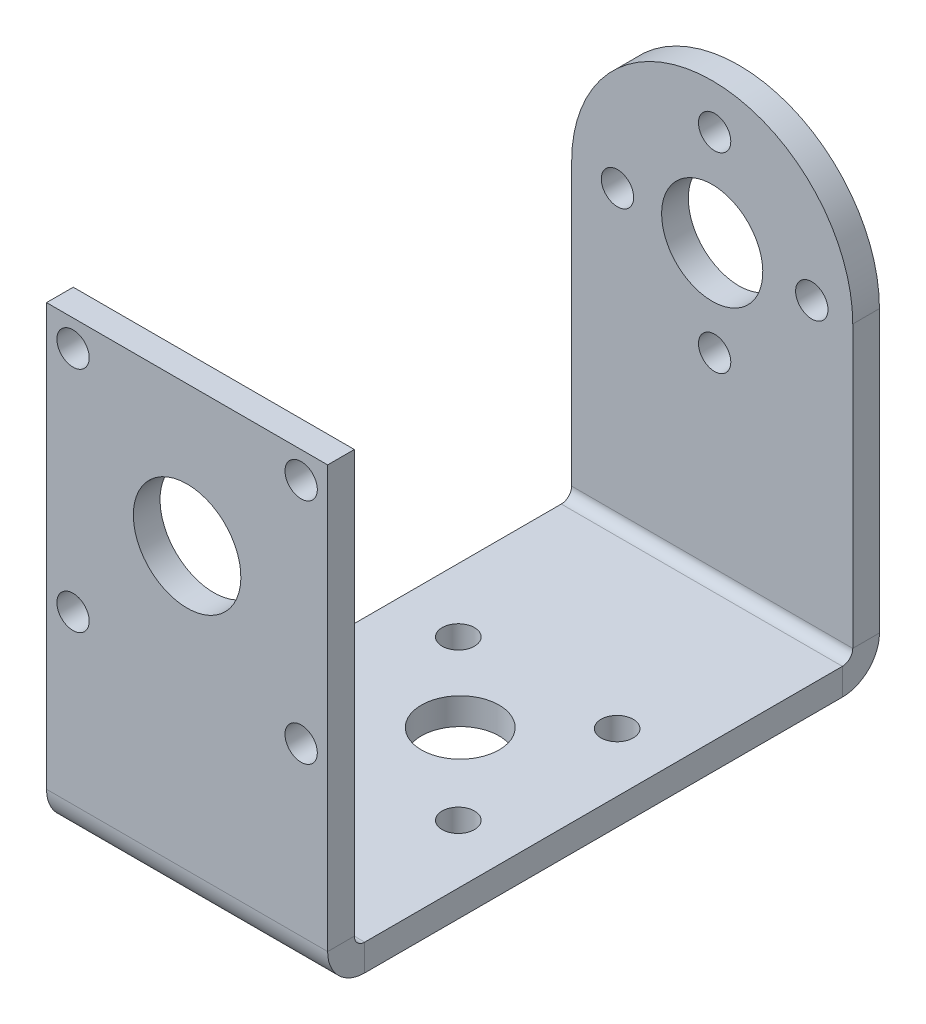
ISO-10303-21;
HEADER;
FILE_DESCRIPTION(('STEP AP214'),'2;1');
FILE_NAME('part.step','',(''),(''),'','','');
FILE_SCHEMA(('AUTOMOTIVE_DESIGN { 1 0 10303 214 1 1 1 1 }'));
ENDSEC;
DATA;
#1=APPLICATION_CONTEXT('core data for automotive mechanical design processes');
#2=APPLICATION_PROTOCOL_DEFINITION('international standard','automotive_design',2000,#1);
#3=PRODUCT_CONTEXT('',#1,'mechanical');
#4=PRODUCT('Part','Part','',(#3));
#5=PRODUCT_RELATED_PRODUCT_CATEGORY('part','',(#4));
#6=PRODUCT_DEFINITION_FORMATION('','',#4);
#7=PRODUCT_DEFINITION_CONTEXT('part definition',#1,'design');
#8=PRODUCT_DEFINITION('design','',#6,#7);
#9=PRODUCT_DEFINITION_SHAPE('','',#8);
#10=(LENGTH_UNIT() NAMED_UNIT(*) SI_UNIT(.MILLI.,.METRE.));
#11=(NAMED_UNIT(*) PLANE_ANGLE_UNIT() SI_UNIT($,.RADIAN.));
#12=(NAMED_UNIT(*) SI_UNIT($,.STERADIAN.) SOLID_ANGLE_UNIT());
#13=UNCERTAINTY_MEASURE_WITH_UNIT(LENGTH_MEASURE(1.E-05),#10,'distance_accuracy_value','');
#14=(GEOMETRIC_REPRESENTATION_CONTEXT(3) GLOBAL_UNCERTAINTY_ASSIGNED_CONTEXT((#13)) GLOBAL_UNIT_ASSIGNED_CONTEXT((#10,
#11,#12)) REPRESENTATION_CONTEXT('',''));
#15=CARTESIAN_POINT('',(0.,0.,0.));
#16=DIRECTION('',(0.,0.,1.));
#17=DIRECTION('',(1.,0.,0.));
#18=AXIS2_PLACEMENT_3D('',#15,#16,#17);
#19=CARTESIAN_POINT('',(-9.99518988819995,-1.9,-34.6890535101453));
#20=DIRECTION('',(0.,1.,0.));
#21=DIRECTION('',(0.,0.,1.));
#22=AXIS2_PLACEMENT_3D('',#19,#20,#21);
#23=PLANE('',#22);
#24=CARTESIAN_POINT('',(-15.4723162915116,-1.9,-0.201962686298737));
#25=DIRECTION('',(0.,1.,0.));
#26=DIRECTION('',(0.,0.,1.));
#27=AXIS2_PLACEMENT_3D('',#24,#25,#26);
#28=CIRCLE('',#27,1.15);
#29=CARTESIAN_POINT('',(-15.4723162915116,-1.9,0.948037313701263));
#30=VERTEX_POINT('',#29);
#31=EDGE_CURVE('E292',#30,#30,#28,.T.);
#32=ORIENTED_EDGE('',*,*,#31,.T.);
#33=EDGE_LOOP('',(#32));
#34=FACE_BOUND('',#33,.T.);
#35=CARTESIAN_POINT('',(-9.82231629151161,-1.9,5.3109464898547));
#36=DIRECTION('',(0.,1.,0.));
#37=DIRECTION('',(0.,0.,1.));
#38=AXIS2_PLACEMENT_3D('',#35,#36,#37);
#39=CIRCLE('',#38,2.765);
#40=CARTESIAN_POINT('',(-9.82231629151161,-1.9,8.0759464898547));
#41=VERTEX_POINT('',#40);
#42=EDGE_CURVE('E286',#41,#41,#39,.T.);
#43=ORIENTED_EDGE('',*,*,#42,.T.);
#44=EDGE_LOOP('',(#43));
#45=FACE_BOUND('',#44,.T.);
#46=CARTESIAN_POINT('',(-15.4723162915116,-1.9,11.0980373137013));
#47=DIRECTION('',(0.,1.,0.));
#48=DIRECTION('',(0.,0.,1.));
#49=AXIS2_PLACEMENT_3D('',#46,#47,#48);
#50=CIRCLE('',#49,1.15);
#51=CARTESIAN_POINT('',(-15.4723162915116,-1.9,12.2480373137013));
#52=VERTEX_POINT('',#51);
#53=EDGE_CURVE('E280',#52,#52,#50,.T.);
#54=ORIENTED_EDGE('',*,*,#53,.T.);
#55=EDGE_LOOP('',(#54));
#56=FACE_BOUND('',#55,.T.);
#57=CARTESIAN_POINT('',(-4.17231629151161,-1.9,-0.201962686298738));
#58=DIRECTION('',(0.,1.,0.));
#59=DIRECTION('',(0.,0.,1.));
#60=AXIS2_PLACEMENT_3D('',#57,#58,#59);
#61=CIRCLE('',#60,1.15);
#62=CARTESIAN_POINT('',(-4.17231629151161,-1.9,0.948037313701262));
#63=VERTEX_POINT('',#62);
#64=EDGE_CURVE('E274',#63,#63,#61,.T.);
#65=ORIENTED_EDGE('',*,*,#64,.T.);
#66=EDGE_LOOP('',(#65));
#67=FACE_BOUND('',#66,.T.);
#68=CARTESIAN_POINT('',(-4.17231629151161,-1.9,11.0980373137013));
#69=DIRECTION('',(0.,1.,0.));
#70=DIRECTION('',(0.,0.,1.));
#71=AXIS2_PLACEMENT_3D('',#68,#69,#70);
#72=CIRCLE('',#71,1.15);
#73=CARTESIAN_POINT('',(-4.17231629151161,-1.9,12.2480373137013));
#74=VERTEX_POINT('',#73);
#75=EDGE_CURVE('E268',#74,#74,#72,.T.);
#76=ORIENTED_EDGE('',*,*,#75,.T.);
#77=EDGE_LOOP('',(#76));
#78=FACE_BOUND('',#77,.T.);
#79=DIRECTION('',(0.,0.,-1.));
#80=VECTOR('',#79,1.);
#81=CARTESIAN_POINT('',(0.00481011180004931,-1.9,-34.6890535101453));
#82=LINE('',#81,#80);
#83=CARTESIAN_POINT('',(0.00481011180006692,-1.9,21.9351060366392));
#84=VERTEX_POINT('',#83);
#85=CARTESIAN_POINT('',(0.00481011180005625,-1.9,-12.0524535101453));
#86=VERTEX_POINT('',#85);
#87=EDGE_CURVE('E47',#84,#86,#82,.T.);
#88=ORIENTED_EDGE('',*,*,#87,.F.);
#89=DIRECTION('',(-1.,0.,0.));
#90=VECTOR('',#89,1.);
#91=CARTESIAN_POINT('',(-9.99518988819993,-1.9,21.9351060366392));
#92=LINE('',#91,#90);
#93=CARTESIAN_POINT('',(-19.9951898881999,-1.9,21.9351060366392));
#94=VERTEX_POINT('',#93);
#95=EDGE_CURVE('E306',#84,#94,#92,.T.);
#96=ORIENTED_EDGE('',*,*,#95,.T.);
#97=DIRECTION('',(0.,0.,1.));
#98=VECTOR('',#97,1.);
#99=CARTESIAN_POINT('',(-19.9951898882,-1.9,-34.6890535101453));
#100=LINE('',#99,#98);
#101=CARTESIAN_POINT('',(-19.9951898881999,-1.9,-12.0524535101453));
#102=VERTEX_POINT('',#101);
#103=EDGE_CURVE('E314',#102,#94,#100,.T.);
#104=ORIENTED_EDGE('',*,*,#103,.F.);
#105=DIRECTION('',(-1.,0.,0.));
#106=VECTOR('',#105,1.);
#107=CARTESIAN_POINT('',(-9.99518988819994,-1.9,-12.0524535101453));
#108=LINE('',#107,#106);
#109=EDGE_CURVE('E297',#86,#102,#108,.T.);
#110=ORIENTED_EDGE('',*,*,#109,.F.);
#111=EDGE_LOOP('',(#88,#96,#104,#110));
#112=FACE_BOUND('',#111,.T.);
#113=ADVANCED_FACE('F43',(#34,#45,#56,#67,#78,#112),#23,.F.);
#114=CARTESIAN_POINT('',(-9.99518988819995,0.,-34.6890535101453));
#115=DIRECTION('',(0.,1.,0.));
#116=DIRECTION('',(0.,0.,1.));
#117=AXIS2_PLACEMENT_3D('',#114,#115,#116);
#118=PLANE('',#117);
#119=DIRECTION('',(-1.,0.,0.));
#120=VECTOR('',#119,1.);
#121=CARTESIAN_POINT('',(-9.99518988819993,0.,21.9351060366392));
#122=LINE('',#121,#120);
#123=CARTESIAN_POINT('',(0.00481011180006692,0.,21.9351060366392));
#124=VERTEX_POINT('',#123);
#125=CARTESIAN_POINT('',(-19.9951898881999,0.,21.9351060366392));
#126=VERTEX_POINT('',#125);
#127=EDGE_CURVE('E52',#124,#126,#122,.T.);
#128=ORIENTED_EDGE('',*,*,#127,.F.);
#129=DIRECTION('',(0.,0.,-1.));
#130=VECTOR('',#129,1.);
#131=CARTESIAN_POINT('',(0.00481011180004931,0.,-34.6890535101453));
#132=LINE('',#131,#130);
#133=CARTESIAN_POINT('',(0.00481011180005635,0.,-12.0524535101453));
#134=VERTEX_POINT('',#133);
#135=EDGE_CURVE('E68',#124,#134,#132,.T.);
#136=ORIENTED_EDGE('',*,*,#135,.T.);
#137=DIRECTION('',(-1.,0.,0.));
#138=VECTOR('',#137,1.);
#139=CARTESIAN_POINT('',(-9.99518988819994,0.,-12.0524535101453));
#140=LINE('',#139,#138);
#141=CARTESIAN_POINT('',(-19.9951898881999,0.,-12.0524535101453));
#142=VERTEX_POINT('',#141);
#143=EDGE_CURVE('E302',#134,#142,#140,.T.);
#144=ORIENTED_EDGE('',*,*,#143,.T.);
#145=DIRECTION('',(0.,0.,1.));
#146=VECTOR('',#145,1.);
#147=CARTESIAN_POINT('',(-19.9951898882,0.,-34.6890535101453));
#148=LINE('',#147,#146);
#149=EDGE_CURVE('E60',#142,#126,#148,.T.);
#150=ORIENTED_EDGE('',*,*,#149,.T.);
#151=EDGE_LOOP('',(#128,#136,#144,#150));
#152=FACE_BOUND('',#151,.T.);
#153=CARTESIAN_POINT('',(-15.4723162915116,0.,-0.201962686298737));
#154=DIRECTION('',(0.,1.,0.));
#155=DIRECTION('',(0.,0.,1.));
#156=AXIS2_PLACEMENT_3D('',#153,#154,#155);
#157=CIRCLE('',#156,1.15);
#158=CARTESIAN_POINT('',(-15.4723162915116,0.,0.948037313701263));
#159=VERTEX_POINT('',#158);
#160=EDGE_CURVE('E289',#159,#159,#157,.T.);
#161=ORIENTED_EDGE('',*,*,#160,.F.);
#162=EDGE_LOOP('',(#161));
#163=FACE_BOUND('',#162,.T.);
#164=CARTESIAN_POINT('',(-9.82231629151161,0.,5.3109464898547));
#165=DIRECTION('',(0.,1.,0.));
#166=DIRECTION('',(0.,0.,1.));
#167=AXIS2_PLACEMENT_3D('',#164,#165,#166);
#168=CIRCLE('',#167,2.765);
#169=CARTESIAN_POINT('',(-9.82231629151161,0.,8.0759464898547));
#170=VERTEX_POINT('',#169);
#171=EDGE_CURVE('E283',#170,#170,#168,.T.);
#172=ORIENTED_EDGE('',*,*,#171,.F.);
#173=EDGE_LOOP('',(#172));
#174=FACE_BOUND('',#173,.T.);
#175=CARTESIAN_POINT('',(-15.4723162915116,0.,11.0980373137013));
#176=DIRECTION('',(0.,1.,0.));
#177=DIRECTION('',(0.,0.,1.));
#178=AXIS2_PLACEMENT_3D('',#175,#176,#177);
#179=CIRCLE('',#178,1.15);
#180=CARTESIAN_POINT('',(-15.4723162915116,0.,12.2480373137013));
#181=VERTEX_POINT('',#180);
#182=EDGE_CURVE('E277',#181,#181,#179,.T.);
#183=ORIENTED_EDGE('',*,*,#182,.F.);
#184=EDGE_LOOP('',(#183));
#185=FACE_BOUND('',#184,.T.);
#186=CARTESIAN_POINT('',(-4.17231629151161,0.,-0.201962686298738));
#187=DIRECTION('',(0.,1.,0.));
#188=DIRECTION('',(0.,0.,1.));
#189=AXIS2_PLACEMENT_3D('',#186,#187,#188);
#190=CIRCLE('',#189,1.15);
#191=CARTESIAN_POINT('',(-4.17231629151161,0.,0.948037313701262));
#192=VERTEX_POINT('',#191);
#193=EDGE_CURVE('E271',#192,#192,#190,.T.);
#194=ORIENTED_EDGE('',*,*,#193,.F.);
#195=EDGE_LOOP('',(#194));
#196=FACE_BOUND('',#195,.T.);
#197=CARTESIAN_POINT('',(-4.17231629151161,0.,11.0980373137013));
#198=DIRECTION('',(0.,1.,0.));
#199=DIRECTION('',(0.,0.,1.));
#200=AXIS2_PLACEMENT_3D('',#197,#198,#199);
#201=CIRCLE('',#200,1.15);
#202=CARTESIAN_POINT('',(-4.17231629151161,0.,12.2480373137013));
#203=VERTEX_POINT('',#202);
#204=EDGE_CURVE('E264',#203,#203,#201,.T.);
#205=ORIENTED_EDGE('',*,*,#204,.F.);
#206=EDGE_LOOP('',(#205));
#207=FACE_BOUND('',#206,.T.);
#208=ADVANCED_FACE('F316',(#152,#163,#174,#185,#196,#207),#118,.T.);
#209=CARTESIAN_POINT('',(-19.9951898882,-1.9,-34.6890535101453));
#210=DIRECTION('',(-1.,0.,0.));
#211=DIRECTION('',(0.,0.,1.));
#212=AXIS2_PLACEMENT_3D('',#209,#210,#211);
#213=PLANE('',#212);
#214=DIRECTION('',(0.,-1.,0.));
#215=VECTOR('',#214,1.);
#216=CARTESIAN_POINT('',(-19.9951898881999,-1.9,21.9351060366392));
#217=LINE('',#216,#215);
#218=EDGE_CURVE('E12',#126,#94,#217,.T.);
#219=ORIENTED_EDGE('',*,*,#218,.F.);
#220=ORIENTED_EDGE('',*,*,#149,.F.);
#221=DIRECTION('',(0.,-1.,0.));
#222=VECTOR('',#221,1.);
#223=CARTESIAN_POINT('',(-19.9951898881999,-1.9,-12.0524535101453));
#224=LINE('',#223,#222);
#225=EDGE_CURVE('E299',#142,#102,#224,.T.);
#226=ORIENTED_EDGE('',*,*,#225,.T.);
#227=ORIENTED_EDGE('',*,*,#103,.T.);
#228=EDGE_LOOP('',(#219,#220,#226,#227));
#229=FACE_BOUND('',#228,.T.);
#230=ADVANCED_FACE('F45',(#229),#213,.T.);
#231=CARTESIAN_POINT('',(0.00481011180004931,-1.9,-34.6890535101453));
#232=DIRECTION('',(1.,0.,0.));
#233=DIRECTION('',(0.,0.,-1.));
#234=AXIS2_PLACEMENT_3D('',#231,#232,#233);
#235=PLANE('',#234);
#236=DIRECTION('',(0.,1.,0.));
#237=VECTOR('',#236,1.);
#238=CARTESIAN_POINT('',(0.00481011180006692,-1.9,21.9351060366392));
#239=LINE('',#238,#237);
#240=EDGE_CURVE('E309',#84,#124,#239,.T.);
#241=ORIENTED_EDGE('',*,*,#240,.F.);
#242=ORIENTED_EDGE('',*,*,#87,.T.);
#243=DIRECTION('',(0.,1.,0.));
#244=VECTOR('',#243,1.);
#245=CARTESIAN_POINT('',(0.00481011180005635,-1.9,-12.0524535101453));
#246=LINE('',#245,#244);
#247=EDGE_CURVE('E304',#86,#134,#246,.T.);
#248=ORIENTED_EDGE('',*,*,#247,.T.);
#249=ORIENTED_EDGE('',*,*,#135,.F.);
#250=EDGE_LOOP('',(#241,#242,#248,#249));
#251=FACE_BOUND('',#250,.T.);
#252=ADVANCED_FACE('F320',(#251),#235,.T.);
#253=CARTESIAN_POINT('',(-15.4723162915116,-1.9,-0.201962686298737));
#254=DIRECTION('',(0.,1.,0.));
#255=DIRECTION('',(0.,0.,1.));
#256=AXIS2_PLACEMENT_3D('',#253,#254,#255);
#257=CYLINDRICAL_SURFACE('',#256,1.15);
#258=ORIENTED_EDGE('',*,*,#31,.F.);
#259=EDGE_LOOP('',(#258));
#260=FACE_BOUND('',#259,.T.);
#261=ORIENTED_EDGE('',*,*,#160,.T.);
#262=EDGE_LOOP('',(#261));
#263=FACE_BOUND('',#262,.T.);
#264=ADVANCED_FACE('F376',(#260,#263),#257,.F.);
#265=CARTESIAN_POINT('',(-9.82231629151161,-1.9,5.3109464898547));
#266=DIRECTION('',(0.,1.,0.));
#267=DIRECTION('',(0.,0.,1.));
#268=AXIS2_PLACEMENT_3D('',#265,#266,#267);
#269=CYLINDRICAL_SURFACE('',#268,2.765);
#270=ORIENTED_EDGE('',*,*,#42,.F.);
#271=EDGE_LOOP('',(#270));
#272=FACE_BOUND('',#271,.T.);
#273=ORIENTED_EDGE('',*,*,#171,.T.);
#274=EDGE_LOOP('',(#273));
#275=FACE_BOUND('',#274,.T.);
#276=ADVANCED_FACE('F383',(#272,#275),#269,.F.);
#277=CARTESIAN_POINT('',(-15.4723162915116,-1.9,11.0980373137013));
#278=DIRECTION('',(0.,1.,0.));
#279=DIRECTION('',(0.,0.,1.));
#280=AXIS2_PLACEMENT_3D('',#277,#278,#279);
#281=CYLINDRICAL_SURFACE('',#280,1.15);
#282=ORIENTED_EDGE('',*,*,#53,.F.);
#283=EDGE_LOOP('',(#282));
#284=FACE_BOUND('',#283,.T.);
#285=ORIENTED_EDGE('',*,*,#182,.T.);
#286=EDGE_LOOP('',(#285));
#287=FACE_BOUND('',#286,.T.);
#288=ADVANCED_FACE('F419',(#284,#287),#281,.F.);
#289=CARTESIAN_POINT('',(-4.17231629151161,-1.9,-0.201962686298738));
#290=DIRECTION('',(0.,1.,0.));
#291=DIRECTION('',(0.,0.,1.));
#292=AXIS2_PLACEMENT_3D('',#289,#290,#291);
#293=CYLINDRICAL_SURFACE('',#292,1.15);
#294=ORIENTED_EDGE('',*,*,#64,.F.);
#295=EDGE_LOOP('',(#294));
#296=FACE_BOUND('',#295,.T.);
#297=ORIENTED_EDGE('',*,*,#193,.T.);
#298=EDGE_LOOP('',(#297));
#299=FACE_BOUND('',#298,.T.);
#300=ADVANCED_FACE('F406',(#296,#299),#293,.F.);
#301=CARTESIAN_POINT('',(-4.17231629151161,-1.9,11.0980373137013));
#302=DIRECTION('',(0.,1.,0.));
#303=DIRECTION('',(0.,0.,1.));
#304=AXIS2_PLACEMENT_3D('',#301,#302,#303);
#305=CYLINDRICAL_SURFACE('',#304,1.15);
#306=ORIENTED_EDGE('',*,*,#75,.F.);
#307=EDGE_LOOP('',(#306));
#308=FACE_BOUND('',#307,.T.);
#309=ORIENTED_EDGE('',*,*,#204,.T.);
#310=EDGE_LOOP('',(#309));
#311=FACE_BOUND('',#310,.T.);
#312=ADVANCED_FACE('F401',(#308,#311),#305,.F.);
#313=CARTESIAN_POINT('',(0.00481011180005625,0.7366,-12.0524535101453));
#314=DIRECTION('',(1.,0.,0.));
#315=DIRECTION('',(0.,0.,-1.));
#316=AXIS2_PLACEMENT_3D('',#313,#314,#315);
#317=PLANE('',#316);
#318=DIRECTION('',(0.,0.,1.));
#319=VECTOR('',#318,1.);
#320=CARTESIAN_POINT('',(0.00481011180005553,0.736600000000009,-14.6890535101453));
#321=LINE('',#320,#319);
#322=CARTESIAN_POINT('',(0.00481011180005533,0.736600000000014,-14.6890535101453));
#323=VERTEX_POINT('',#322);
#324=CARTESIAN_POINT('',(0.00481011180005619,0.736599999999999,-12.7890535101453));
#325=VERTEX_POINT('',#324);
#326=EDGE_CURVE('E191',#323,#325,#321,.T.);
#327=ORIENTED_EDGE('',*,*,#326,.T.);
#328=CARTESIAN_POINT('',(0.00481011180005625,0.7366,-12.0524535101453));
#329=DIRECTION('',(1.,0.,0.));
#330=DIRECTION('',(0.,0.,-1.));
#331=AXIS2_PLACEMENT_3D('',#328,#329,#330);
#332=CIRCLE('',#331,0.7366);
#333=EDGE_CURVE('E199',#325,#134,#332,.F.);
#334=ORIENTED_EDGE('',*,*,#333,.T.);
#335=ORIENTED_EDGE('',*,*,#247,.F.);
#336=CARTESIAN_POINT('',(0.00481011180005625,0.7366,-12.0524535101453));
#337=DIRECTION('',(-1.,0.,0.));
#338=DIRECTION('',(0.,0.,-1.));
#339=AXIS2_PLACEMENT_3D('',#336,#337,#338);
#340=CIRCLE('',#339,2.6366);
#341=EDGE_CURVE('E257',#323,#86,#340,.T.);
#342=ORIENTED_EDGE('',*,*,#341,.F.);
#343=EDGE_LOOP('',(#327,#334,#335,#342));
#344=FACE_BOUND('',#343,.T.);
#345=ADVANCED_FACE('F324',(#344),#317,.T.);
#346=CARTESIAN_POINT('',(-19.9951898881999,0.7366,-12.0524535101453));
#347=DIRECTION('',(-1.,0.,0.));
#348=DIRECTION('',(0.,0.,1.));
#349=AXIS2_PLACEMENT_3D('',#346,#347,#348);
#350=PLANE('',#349);
#351=CARTESIAN_POINT('',(-19.9951898881999,0.7366,-12.0524535101453));
#352=DIRECTION('',(1.,0.,0.));
#353=DIRECTION('',(0.,0.,-1.));
#354=AXIS2_PLACEMENT_3D('',#351,#352,#353);
#355=CIRCLE('',#354,0.7366);
#356=CARTESIAN_POINT('',(-19.9951898881999,0.736600000000006,-12.7890535101453));
#357=VERTEX_POINT('',#356);
#358=EDGE_CURVE('E261',#142,#357,#355,.T.);
#359=ORIENTED_EDGE('',*,*,#358,.T.);
#360=DIRECTION('',(0.,0.,-1.));
#361=VECTOR('',#360,1.);
#362=CARTESIAN_POINT('',(-19.9951898881999,0.736600000000009,-14.6890535101453));
#363=LINE('',#362,#361);
#364=CARTESIAN_POINT('',(-19.9951898881999,0.736600000000009,-14.6890535101453));
#365=VERTEX_POINT('',#364);
#366=EDGE_CURVE('E249',#357,#365,#363,.T.);
#367=ORIENTED_EDGE('',*,*,#366,.T.);
#368=CARTESIAN_POINT('',(-19.9951898881999,0.7366,-12.0524535101453));
#369=DIRECTION('',(1.,0.,0.));
#370=DIRECTION('',(0.,0.,1.));
#371=AXIS2_PLACEMENT_3D('',#368,#369,#370);
#372=CIRCLE('',#371,2.6366);
#373=EDGE_CURVE('E260',#102,#365,#372,.T.);
#374=ORIENTED_EDGE('',*,*,#373,.F.);
#375=ORIENTED_EDGE('',*,*,#225,.F.);
#376=EDGE_LOOP('',(#359,#367,#374,#375));
#377=FACE_BOUND('',#376,.T.);
#378=ADVANCED_FACE('F340',(#377),#350,.T.);
#379=CARTESIAN_POINT('',(-30.2591682101436,0.7366,-12.0524535101453));
#380=DIRECTION('',(1.,0.,0.));
#381=DIRECTION('',(0.,0.,-1.));
#382=AXIS2_PLACEMENT_3D('',#379,#380,#381);
#383=CYLINDRICAL_SURFACE('',#382,2.6366);
#384=ORIENTED_EDGE('',*,*,#109,.T.);
#385=ORIENTED_EDGE('',*,*,#373,.T.);
#386=DIRECTION('',(-1.,0.,0.));
#387=VECTOR('',#386,1.);
#388=CARTESIAN_POINT('',(-9.99518988819994,0.736600000000009,-14.6890535101453));
#389=LINE('',#388,#387);
#390=EDGE_CURVE('E212',#323,#365,#389,.T.);
#391=ORIENTED_EDGE('',*,*,#390,.F.);
#392=ORIENTED_EDGE('',*,*,#341,.T.);
#393=EDGE_LOOP('',(#384,#385,#391,#392));
#394=FACE_BOUND('',#393,.T.);
#395=ADVANCED_FACE('F328',(#394),#383,.T.);
#396=CARTESIAN_POINT('',(-30.2591682101436,0.7366,-12.0524535101453));
#397=DIRECTION('',(1.,0.,0.));
#398=DIRECTION('',(0.,0.,-1.));
#399=AXIS2_PLACEMENT_3D('',#396,#397,#398);
#400=CYLINDRICAL_SURFACE('',#399,0.7366);
#401=ORIENTED_EDGE('',*,*,#143,.F.);
#402=ORIENTED_EDGE('',*,*,#333,.F.);
#403=DIRECTION('',(-1.,0.,0.));
#404=VECTOR('',#403,1.);
#405=CARTESIAN_POINT('',(-9.99518988819994,0.736600000000002,-12.7890535101453));
#406=LINE('',#405,#404);
#407=EDGE_CURVE('E252',#325,#357,#406,.T.);
#408=ORIENTED_EDGE('',*,*,#407,.T.);
#409=ORIENTED_EDGE('',*,*,#358,.F.);
#410=EDGE_LOOP('',(#401,#402,#408,#409));
#411=FACE_BOUND('',#410,.T.);
#412=ADVANCED_FACE('F344',(#411),#400,.F.);
#413=CARTESIAN_POINT('',(-9.99518988819994,20.7238949152277,-14.6890535101452));
#414=DIRECTION('',(0.,0.,1.));
#415=DIRECTION('',(0.,-1.,0.));
#416=AXIS2_PLACEMENT_3D('',#413,#414,#415);
#417=CYLINDRICAL_SURFACE('',#416,10.);
#418=CARTESIAN_POINT('',(-9.99518988819994,20.7238949152277,-12.7890535101452));
#419=DIRECTION('',(0.,0.,1.));
#420=DIRECTION('',(0.,-1.,0.));
#421=AXIS2_PLACEMENT_3D('',#418,#419,#420);
#422=CIRCLE('',#421,10.);
#423=CARTESIAN_POINT('',(0.00481011180005691,20.7238949152277,-12.7890535101452));
#424=VERTEX_POINT('',#423);
#425=CARTESIAN_POINT('',(-19.9951898881999,20.7238949152277,-12.7890535101452));
#426=VERTEX_POINT('',#425);
#427=EDGE_CURVE('E204',#424,#426,#422,.T.);
#428=ORIENTED_EDGE('',*,*,#427,.F.);
#429=DIRECTION('',(0.,0.,1.));
#430=VECTOR('',#429,1.);
#431=CARTESIAN_POINT('',(0.00481011180005625,20.7238949152277,-14.6890535101452));
#432=LINE('',#431,#430);
#433=CARTESIAN_POINT('',(0.00481011180005625,20.7238949152277,-14.6890535101452));
#434=VERTEX_POINT('',#433);
#435=EDGE_CURVE('E196',#434,#424,#432,.T.);
#436=ORIENTED_EDGE('',*,*,#435,.F.);
#437=CARTESIAN_POINT('',(-9.99518988819994,20.7238949152277,-14.6890535101452));
#438=DIRECTION('',(0.,0.,1.));
#439=DIRECTION('',(0.,-1.,0.));
#440=AXIS2_PLACEMENT_3D('',#437,#438,#439);
#441=CIRCLE('',#440,10.);
#442=CARTESIAN_POINT('',(-19.9951898881999,20.7238949152277,-14.6890535101452));
#443=VERTEX_POINT('',#442);
#444=EDGE_CURVE('E246',#434,#443,#441,.T.);
#445=ORIENTED_EDGE('',*,*,#444,.T.);
#446=DIRECTION('',(0.,0.,1.));
#447=VECTOR('',#446,1.);
#448=CARTESIAN_POINT('',(-19.9951898881999,20.7238949152277,-14.6890535101452));
#449=LINE('',#448,#447);
#450=EDGE_CURVE('E244',#443,#426,#449,.T.);
#451=ORIENTED_EDGE('',*,*,#450,.T.);
#452=EDGE_LOOP('',(#428,#436,#445,#451));
#453=FACE_BOUND('',#452,.T.);
#454=ADVANCED_FACE('F471',(#453),#417,.T.);
#455=CARTESIAN_POINT('',(-9.8223162915116,14.0338705643409,-14.6890535101453));
#456=DIRECTION('',(0.,0.,1.));
#457=DIRECTION('',(0.,-1.,0.));
#458=AXIS2_PLACEMENT_3D('',#455,#456,#457);
#459=CYLINDRICAL_SURFACE('',#458,1.15);
#460=CARTESIAN_POINT('',(-9.8223162915116,14.0338705643409,-14.6890535101453));
#461=DIRECTION('',(0.,0.,1.));
#462=DIRECTION('',(0.,-1.,0.));
#463=AXIS2_PLACEMENT_3D('',#460,#461,#462);
#464=CIRCLE('',#463,1.15);
#465=CARTESIAN_POINT('',(-9.8223162915116,12.8838705643409,-14.6890535101453));
#466=VERTEX_POINT('',#465);
#467=EDGE_CURVE('E214',#466,#466,#464,.T.);
#468=ORIENTED_EDGE('',*,*,#467,.F.);
#469=EDGE_LOOP('',(#468));
#470=FACE_BOUND('',#469,.T.);
#471=CARTESIAN_POINT('',(-9.8223162915116,14.0338705643409,-12.7890535101453));
#472=DIRECTION('',(0.,0.,1.));
#473=DIRECTION('',(0.,-1.,0.));
#474=AXIS2_PLACEMENT_3D('',#471,#472,#473);
#475=CIRCLE('',#474,1.15);
#476=CARTESIAN_POINT('',(-9.8223162915116,12.8838705643409,-12.7890535101453));
#477=VERTEX_POINT('',#476);
#478=EDGE_CURVE('E241',#477,#477,#475,.T.);
#479=ORIENTED_EDGE('',*,*,#478,.T.);
#480=EDGE_LOOP('',(#479));
#481=FACE_BOUND('',#480,.T.);
#482=ADVANCED_FACE('F478',(#470,#481),#459,.F.);
#483=CARTESIAN_POINT('',(-9.82231629151159,27.6363949152277,-14.6890535101452));
#484=DIRECTION('',(0.,0.,1.));
#485=DIRECTION('',(0.,-1.,0.));
#486=AXIS2_PLACEMENT_3D('',#483,#484,#485);
#487=CYLINDRICAL_SURFACE('',#486,1.15);
#488=CARTESIAN_POINT('',(-9.82231629151159,27.6363949152277,-14.6890535101452));
#489=DIRECTION('',(0.,0.,1.));
#490=DIRECTION('',(0.,-1.,0.));
#491=AXIS2_PLACEMENT_3D('',#488,#489,#490);
#492=CIRCLE('',#491,1.15);
#493=CARTESIAN_POINT('',(-9.82231629151159,26.4863949152277,-14.6890535101452));
#494=VERTEX_POINT('',#493);
#495=EDGE_CURVE('E217',#494,#494,#492,.T.);
#496=ORIENTED_EDGE('',*,*,#495,.F.);
#497=EDGE_LOOP('',(#496));
#498=FACE_BOUND('',#497,.T.);
#499=CARTESIAN_POINT('',(-9.82231629151159,27.6363949152277,-12.7890535101452));
#500=DIRECTION('',(0.,0.,1.));
#501=DIRECTION('',(0.,-1.,0.));
#502=AXIS2_PLACEMENT_3D('',#499,#500,#501);
#503=CIRCLE('',#502,1.15);
#504=CARTESIAN_POINT('',(-9.82231629151159,26.4863949152277,-12.7890535101452));
#505=VERTEX_POINT('',#504);
#506=EDGE_CURVE('E238',#505,#505,#503,.T.);
#507=ORIENTED_EDGE('',*,*,#506,.T.);
#508=EDGE_LOOP('',(#507));
#509=FACE_BOUND('',#508,.T.);
#510=ADVANCED_FACE('F491',(#498,#509),#487,.F.);
#511=CARTESIAN_POINT('',(-2.9098162915116,20.7238949152277,-14.6890535101452));
#512=DIRECTION('',(0.,0.,1.));
#513=DIRECTION('',(0.,-1.,0.));
#514=AXIS2_PLACEMENT_3D('',#511,#512,#513);
#515=CYLINDRICAL_SURFACE('',#514,1.15);
#516=CARTESIAN_POINT('',(-2.9098162915116,20.7238949152277,-14.6890535101452));
#517=DIRECTION('',(0.,0.,1.));
#518=DIRECTION('',(0.,-1.,0.));
#519=AXIS2_PLACEMENT_3D('',#516,#517,#518);
#520=CIRCLE('',#519,1.15);
#521=CARTESIAN_POINT('',(-2.9098162915116,19.5738949152277,-14.6890535101453));
#522=VERTEX_POINT('',#521);
#523=EDGE_CURVE('E220',#522,#522,#520,.T.);
#524=ORIENTED_EDGE('',*,*,#523,.F.);
#525=EDGE_LOOP('',(#524));
#526=FACE_BOUND('',#525,.T.);
#527=CARTESIAN_POINT('',(-2.90981629151159,20.7238949152277,-12.7890535101452));
#528=DIRECTION('',(0.,0.,1.));
#529=DIRECTION('',(0.,-1.,0.));
#530=AXIS2_PLACEMENT_3D('',#527,#528,#529);
#531=CIRCLE('',#530,1.15);
#532=CARTESIAN_POINT('',(-2.90981629151159,19.5738949152277,-12.7890535101453));
#533=VERTEX_POINT('',#532);
#534=EDGE_CURVE('E235',#533,#533,#531,.T.);
#535=ORIENTED_EDGE('',*,*,#534,.T.);
#536=EDGE_LOOP('',(#535));
#537=FACE_BOUND('',#536,.T.);
#538=ADVANCED_FACE('F502',(#526,#537),#515,.F.);
#539=CARTESIAN_POINT('',(-16.7348162915116,20.7238949152277,-14.6890535101452));
#540=DIRECTION('',(0.,0.,1.));
#541=DIRECTION('',(0.,-1.,0.));
#542=AXIS2_PLACEMENT_3D('',#539,#540,#541);
#543=CYLINDRICAL_SURFACE('',#542,1.15);
#544=CARTESIAN_POINT('',(-16.7348162915116,20.7238949152277,-14.6890535101452));
#545=DIRECTION('',(0.,0.,1.));
#546=DIRECTION('',(0.,-1.,0.));
#547=AXIS2_PLACEMENT_3D('',#544,#545,#546);
#548=CIRCLE('',#547,1.15);
#549=CARTESIAN_POINT('',(-16.7348162915116,19.5738949152277,-14.6890535101452));
#550=VERTEX_POINT('',#549);
#551=EDGE_CURVE('E223',#550,#550,#548,.T.);
#552=ORIENTED_EDGE('',*,*,#551,.F.);
#553=EDGE_LOOP('',(#552));
#554=FACE_BOUND('',#553,.T.);
#555=CARTESIAN_POINT('',(-16.7348162915116,20.7238949152277,-12.7890535101452));
#556=DIRECTION('',(0.,0.,1.));
#557=DIRECTION('',(0.,-1.,0.));
#558=AXIS2_PLACEMENT_3D('',#555,#556,#557);
#559=CIRCLE('',#558,1.15);
#560=CARTESIAN_POINT('',(-16.7348162915116,19.5738949152277,-12.7890535101452));
#561=VERTEX_POINT('',#560);
#562=EDGE_CURVE('E232',#561,#561,#559,.T.);
#563=ORIENTED_EDGE('',*,*,#562,.T.);
#564=EDGE_LOOP('',(#563));
#565=FACE_BOUND('',#564,.T.);
#566=ADVANCED_FACE('F513',(#554,#565),#543,.F.);
#567=CARTESIAN_POINT('',(-9.99518988819994,20.7238949152277,-14.6890535101452));
#568=DIRECTION('',(0.,0.,1.));
#569=DIRECTION('',(0.,-1.,0.));
#570=AXIS2_PLACEMENT_3D('',#567,#568,#569);
#571=CYLINDRICAL_SURFACE('',#570,3.60002435088678);
#572=CARTESIAN_POINT('',(-9.99518988819994,20.7238949152277,-14.6890535101452));
#573=DIRECTION('',(0.,0.,1.));
#574=DIRECTION('',(0.,-1.,0.));
#575=AXIS2_PLACEMENT_3D('',#572,#573,#574);
#576=CIRCLE('',#575,3.60002435088678);
#577=CARTESIAN_POINT('',(-9.99518988819995,17.1238705643409,-14.6890535101453));
#578=VERTEX_POINT('',#577);
#579=EDGE_CURVE('E226',#578,#578,#576,.T.);
#580=ORIENTED_EDGE('',*,*,#579,.F.);
#581=EDGE_LOOP('',(#580));
#582=FACE_BOUND('',#581,.T.);
#583=CARTESIAN_POINT('',(-9.99518988819994,20.7238949152277,-12.7890535101452));
#584=DIRECTION('',(0.,0.,1.));
#585=DIRECTION('',(0.,-1.,0.));
#586=AXIS2_PLACEMENT_3D('',#583,#584,#585);
#587=CIRCLE('',#586,3.60002435088678);
#588=CARTESIAN_POINT('',(-9.99518988819995,17.1238705643409,-12.7890535101453));
#589=VERTEX_POINT('',#588);
#590=EDGE_CURVE('E229',#589,#589,#587,.T.);
#591=ORIENTED_EDGE('',*,*,#590,.T.);
#592=EDGE_LOOP('',(#591));
#593=FACE_BOUND('',#592,.T.);
#594=ADVANCED_FACE('F524',(#582,#593),#571,.F.);
#595=CARTESIAN_POINT('',(-9.99518988819994,20.7238949152277,-14.6890535101452));
#596=DIRECTION('',(0.,0.,1.));
#597=DIRECTION('',(0.,-1.,0.));
#598=AXIS2_PLACEMENT_3D('',#595,#596,#597);
#599=PLANE('',#598);
#600=ORIENTED_EDGE('',*,*,#579,.T.);
#601=EDGE_LOOP('',(#600));
#602=FACE_BOUND('',#601,.T.);
#603=ORIENTED_EDGE('',*,*,#551,.T.);
#604=EDGE_LOOP('',(#603));
#605=FACE_BOUND('',#604,.T.);
#606=ORIENTED_EDGE('',*,*,#523,.T.);
#607=EDGE_LOOP('',(#606));
#608=FACE_BOUND('',#607,.T.);
#609=ORIENTED_EDGE('',*,*,#495,.T.);
#610=EDGE_LOOP('',(#609));
#611=FACE_BOUND('',#610,.T.);
#612=ORIENTED_EDGE('',*,*,#467,.T.);
#613=EDGE_LOOP('',(#612));
#614=FACE_BOUND('',#613,.T.);
#615=DIRECTION('',(0.,1.,0.));
#616=VECTOR('',#615,1.);
#617=CARTESIAN_POINT('',(0.00481011180005625,20.7238949152277,-14.6890535101452));
#618=LINE('',#617,#616);
#619=EDGE_CURVE('E200',#323,#434,#618,.T.);
#620=ORIENTED_EDGE('',*,*,#619,.F.);
#621=ORIENTED_EDGE('',*,*,#390,.T.);
#622=DIRECTION('',(0.,-1.,0.));
#623=VECTOR('',#622,1.);
#624=CARTESIAN_POINT('',(-19.9951898881999,20.7238949152277,-14.6890535101452));
#625=LINE('',#624,#623);
#626=EDGE_CURVE('E209',#443,#365,#625,.T.);
#627=ORIENTED_EDGE('',*,*,#626,.F.);
#628=ORIENTED_EDGE('',*,*,#444,.F.);
#629=EDGE_LOOP('',(#620,#621,#627,#628));
#630=FACE_BOUND('',#629,.T.);
#631=ADVANCED_FACE('F333',(#602,#605,#608,#611,#614,#630),#599,.F.);
#632=CARTESIAN_POINT('',(-19.9951898881999,20.7238949152277,-14.6890535101452));
#633=DIRECTION('',(-1.,0.,0.));
#634=DIRECTION('',(0.,-1.,0.));
#635=AXIS2_PLACEMENT_3D('',#632,#633,#634);
#636=PLANE('',#635);
#637=ORIENTED_EDGE('',*,*,#366,.F.);
#638=DIRECTION('',(0.,-1.,0.));
#639=VECTOR('',#638,1.);
#640=CARTESIAN_POINT('',(-19.9951898881999,20.7238949152277,-12.7890535101452));
#641=LINE('',#640,#639);
#642=EDGE_CURVE('E202',#426,#357,#641,.T.);
#643=ORIENTED_EDGE('',*,*,#642,.F.);
#644=ORIENTED_EDGE('',*,*,#450,.F.);
#645=ORIENTED_EDGE('',*,*,#626,.T.);
#646=EDGE_LOOP('',(#637,#643,#644,#645));
#647=FACE_BOUND('',#646,.T.);
#648=ADVANCED_FACE('F337',(#647),#636,.T.);
#649=CARTESIAN_POINT('',(-9.99518988819994,20.7238949152277,-12.7890535101452));
#650=DIRECTION('',(0.,0.,1.));
#651=DIRECTION('',(0.,-1.,0.));
#652=AXIS2_PLACEMENT_3D('',#649,#650,#651);
#653=PLANE('',#652);
#654=ORIENTED_EDGE('',*,*,#407,.F.);
#655=DIRECTION('',(0.,1.,0.));
#656=VECTOR('',#655,1.);
#657=CARTESIAN_POINT('',(0.00481011180005691,20.7238949152277,-12.7890535101452));
#658=LINE('',#657,#656);
#659=EDGE_CURVE('E207',#325,#424,#658,.T.);
#660=ORIENTED_EDGE('',*,*,#659,.T.);
#661=ORIENTED_EDGE('',*,*,#427,.T.);
#662=ORIENTED_EDGE('',*,*,#642,.T.);
#663=EDGE_LOOP('',(#654,#660,#661,#662));
#664=FACE_BOUND('',#663,.T.);
#665=ORIENTED_EDGE('',*,*,#478,.F.);
#666=EDGE_LOOP('',(#665));
#667=FACE_BOUND('',#666,.T.);
#668=ORIENTED_EDGE('',*,*,#506,.F.);
#669=EDGE_LOOP('',(#668));
#670=FACE_BOUND('',#669,.T.);
#671=ORIENTED_EDGE('',*,*,#534,.F.);
#672=EDGE_LOOP('',(#671));
#673=FACE_BOUND('',#672,.T.);
#674=ORIENTED_EDGE('',*,*,#562,.F.);
#675=EDGE_LOOP('',(#674));
#676=FACE_BOUND('',#675,.T.);
#677=ORIENTED_EDGE('',*,*,#590,.F.);
#678=EDGE_LOOP('',(#677));
#679=FACE_BOUND('',#678,.T.);
#680=ADVANCED_FACE('F547',(#664,#667,#670,#673,#676,#679),#653,.T.);
#681=CARTESIAN_POINT('',(0.00481011180005625,20.7238949152277,-14.6890535101452));
#682=DIRECTION('',(1.,0.,0.));
#683=DIRECTION('',(0.,1.,0.));
#684=AXIS2_PLACEMENT_3D('',#681,#682,#683);
#685=PLANE('',#684);
#686=ORIENTED_EDGE('',*,*,#326,.F.);
#687=ORIENTED_EDGE('',*,*,#619,.T.);
#688=ORIENTED_EDGE('',*,*,#435,.T.);
#689=ORIENTED_EDGE('',*,*,#659,.F.);
#690=EDGE_LOOP('',(#686,#687,#688,#689));
#691=FACE_BOUND('',#690,.T.);
#692=ADVANCED_FACE('F553',(#691),#685,.T.);
#693=CARTESIAN_POINT('',(0.00481011180006492,0.7366,21.9351060366392));
#694=DIRECTION('',(1.,0.,0.));
#695=DIRECTION('',(0.,0.,-1.));
#696=AXIS2_PLACEMENT_3D('',#693,#694,#695);
#697=PLANE('',#696);
#698=ORIENTED_EDGE('',*,*,#240,.T.);
#699=CARTESIAN_POINT('',(0.00481011180006492,0.7366,21.9351060366392));
#700=DIRECTION('',(-1.,0.,0.));
#701=DIRECTION('',(0.,0.,1.));
#702=AXIS2_PLACEMENT_3D('',#699,#700,#701);
#703=CIRCLE('',#702,0.7366);
#704=CARTESIAN_POINT('',(0.00481011180006615,0.736600000000011,22.6717060366392));
#705=VERTEX_POINT('',#704);
#706=EDGE_CURVE('E155',#124,#705,#703,.T.);
#707=ORIENTED_EDGE('',*,*,#706,.T.);
#708=DIRECTION('',(0.,0.,-1.));
#709=VECTOR('',#708,1.);
#710=CARTESIAN_POINT('',(0.00481011180006681,0.736600000000011,24.5717060366392));
#711=LINE('',#710,#709);
#712=CARTESIAN_POINT('',(0.00481011180006681,0.736600000000018,24.5717060366392));
#713=VERTEX_POINT('',#712);
#714=EDGE_CURVE('E362',#713,#705,#711,.T.);
#715=ORIENTED_EDGE('',*,*,#714,.F.);
#716=CARTESIAN_POINT('',(0.00481011180006492,0.7366,21.9351060366392));
#717=DIRECTION('',(-1.,0.,0.));
#718=DIRECTION('',(0.,0.,-1.));
#719=AXIS2_PLACEMENT_3D('',#716,#717,#718);
#720=CIRCLE('',#719,2.6366);
#721=EDGE_CURVE('E184',#84,#713,#720,.T.);
#722=ORIENTED_EDGE('',*,*,#721,.F.);
#723=EDGE_LOOP('',(#698,#707,#715,#722));
#724=FACE_BOUND('',#723,.T.);
#725=ADVANCED_FACE('F359',(#724),#697,.T.);
#726=CARTESIAN_POINT('',(-19.9951898881999,0.7366,21.9351060366392));
#727=DIRECTION('',(-1.,0.,0.));
#728=DIRECTION('',(0.,0.,1.));
#729=AXIS2_PLACEMENT_3D('',#726,#727,#728);
#730=PLANE('',#729);
#731=DIRECTION('',(0.,0.,1.));
#732=VECTOR('',#731,1.);
#733=CARTESIAN_POINT('',(-19.9951898881999,0.736600000000011,24.5717060366392));
#734=LINE('',#733,#732);
#735=CARTESIAN_POINT('',(-19.9951898881999,0.736600000000004,22.6717060366392));
#736=VERTEX_POINT('',#735);
#737=CARTESIAN_POINT('',(-19.9951898881999,0.736600000000008,24.5717060366392));
#738=VERTEX_POINT('',#737);
#739=EDGE_CURVE('E143',#736,#738,#734,.T.);
#740=ORIENTED_EDGE('',*,*,#739,.F.);
#741=CARTESIAN_POINT('',(-19.9951898881999,0.7366,21.9351060366392));
#742=DIRECTION('',(-1.,0.,0.));
#743=DIRECTION('',(0.,0.,1.));
#744=AXIS2_PLACEMENT_3D('',#741,#742,#743);
#745=CIRCLE('',#744,0.7366);
#746=EDGE_CURVE('E188',#736,#126,#745,.F.);
#747=ORIENTED_EDGE('',*,*,#746,.T.);
#748=ORIENTED_EDGE('',*,*,#218,.T.);
#749=CARTESIAN_POINT('',(-19.9951898881999,0.7366,21.9351060366392));
#750=DIRECTION('',(1.,0.,0.));
#751=DIRECTION('',(0.,0.,1.));
#752=AXIS2_PLACEMENT_3D('',#749,#750,#751);
#753=CIRCLE('',#752,2.6366);
#754=EDGE_CURVE('E187',#738,#94,#753,.T.);
#755=ORIENTED_EDGE('',*,*,#754,.F.);
#756=EDGE_LOOP('',(#740,#747,#748,#755));
#757=FACE_BOUND('',#756,.T.);
#758=ADVANCED_FACE('F350',(#757),#730,.T.);
#759=CARTESIAN_POINT('',(10.2687884337437,0.7366,21.9351060366392));
#760=DIRECTION('',(-1.,0.,0.));
#761=DIRECTION('',(0.,0.,1.));
#762=AXIS2_PLACEMENT_3D('',#759,#760,#761);
#763=CYLINDRICAL_SURFACE('',#762,2.6366);
#764=ORIENTED_EDGE('',*,*,#754,.T.);
#765=ORIENTED_EDGE('',*,*,#95,.F.);
#766=ORIENTED_EDGE('',*,*,#721,.T.);
#767=DIRECTION('',(-1.,0.,0.));
#768=VECTOR('',#767,1.);
#769=CARTESIAN_POINT('',(-9.99518988819993,0.736600000000014,24.5717060366392));
#770=LINE('',#769,#768);
#771=EDGE_CURVE('E182',#713,#738,#770,.T.);
#772=ORIENTED_EDGE('',*,*,#771,.T.);
#773=EDGE_LOOP('',(#764,#765,#766,#772));
#774=FACE_BOUND('',#773,.T.);
#775=ADVANCED_FACE('F365',(#774),#763,.T.);
#776=CARTESIAN_POINT('',(10.2687884337437,0.7366,21.9351060366392));
#777=DIRECTION('',(-1.,0.,0.));
#778=DIRECTION('',(0.,0.,1.));
#779=AXIS2_PLACEMENT_3D('',#776,#777,#778);
#780=CYLINDRICAL_SURFACE('',#779,0.7366);
#781=ORIENTED_EDGE('',*,*,#746,.F.);
#782=DIRECTION('',(-1.,0.,0.));
#783=VECTOR('',#782,1.);
#784=CARTESIAN_POINT('',(-9.99518988819993,0.736600000000007,22.6717060366392));
#785=LINE('',#784,#783);
#786=EDGE_CURVE('E356',#705,#736,#785,.T.);
#787=ORIENTED_EDGE('',*,*,#786,.F.);
#788=ORIENTED_EDGE('',*,*,#706,.F.);
#789=ORIENTED_EDGE('',*,*,#127,.T.);
#790=EDGE_LOOP('',(#781,#787,#788,#789));
#791=FACE_BOUND('',#790,.T.);
#792=ADVANCED_FACE('F354',(#791),#780,.F.);
#793=CARTESIAN_POINT('',(-9.99518988819995,20.7238949152277,24.5717060366392));
#794=DIRECTION('',(0.,0.,-1.));
#795=DIRECTION('',(0.,1.,0.));
#796=AXIS2_PLACEMENT_3D('',#793,#794,#795);
#797=CYLINDRICAL_SURFACE('',#796,3.825);
#798=CARTESIAN_POINT('',(-9.99518988819995,20.7238949152277,24.5717060366392));
#799=DIRECTION('',(0.,0.,-1.));
#800=DIRECTION('',(0.,1.,0.));
#801=AXIS2_PLACEMENT_3D('',#798,#799,#800);
#802=CIRCLE('',#801,3.825);
#803=CARTESIAN_POINT('',(-9.99518988819995,24.5488949152277,24.5717060366392));
#804=VERTEX_POINT('',#803);
#805=EDGE_CURVE('E792',#804,#804,#802,.T.);
#806=ORIENTED_EDGE('',*,*,#805,.F.);
#807=EDGE_LOOP('',(#806));
#808=FACE_BOUND('',#807,.T.);
#809=CARTESIAN_POINT('',(-9.99518988819995,20.7238949152277,22.6717060366392));
#810=DIRECTION('',(0.,0.,-1.));
#811=DIRECTION('',(0.,1.,0.));
#812=AXIS2_PLACEMENT_3D('',#809,#810,#811);
#813=CIRCLE('',#812,3.825);
#814=CARTESIAN_POINT('',(-9.99518988819995,24.5488949152277,22.6717060366392));
#815=VERTEX_POINT('',#814);
#816=EDGE_CURVE('E179',#815,#815,#813,.T.);
#817=ORIENTED_EDGE('',*,*,#816,.T.);
#818=EDGE_LOOP('',(#817));
#819=FACE_BOUND('',#818,.T.);
#820=ADVANCED_FACE('F566',(#808,#819),#797,.F.);
#821=CARTESIAN_POINT('',(-1.88018988819994,28.8388949152277,24.5717060366391));
#822=DIRECTION('',(0.,0.,-1.));
#823=DIRECTION('',(0.,1.,0.));
#824=AXIS2_PLACEMENT_3D('',#821,#822,#823);
#825=CYLINDRICAL_SURFACE('',#824,1.15);
#826=CARTESIAN_POINT('',(-1.88018988819994,28.8388949152277,24.5717060366391));
#827=DIRECTION('',(0.,0.,-1.));
#828=DIRECTION('',(0.,1.,0.));
#829=AXIS2_PLACEMENT_3D('',#826,#827,#828);
#830=CIRCLE('',#829,1.15);
#831=CARTESIAN_POINT('',(-1.88018988819994,29.9888949152277,24.5717060366391));
#832=VERTEX_POINT('',#831);
#833=EDGE_CURVE('E798',#832,#832,#830,.T.);
#834=ORIENTED_EDGE('',*,*,#833,.F.);
#835=EDGE_LOOP('',(#834));
#836=FACE_BOUND('',#835,.T.);
#837=CARTESIAN_POINT('',(-1.88018988819994,28.8388949152277,22.6717060366391));
#838=DIRECTION('',(0.,0.,-1.));
#839=DIRECTION('',(0.,1.,0.));
#840=AXIS2_PLACEMENT_3D('',#837,#838,#839);
#841=CIRCLE('',#840,1.15);
#842=CARTESIAN_POINT('',(-1.88018988819994,29.9888949152277,22.6717060366391));
#843=VERTEX_POINT('',#842);
#844=EDGE_CURVE('E176',#843,#843,#841,.T.);
#845=ORIENTED_EDGE('',*,*,#844,.T.);
#846=EDGE_LOOP('',(#845));
#847=FACE_BOUND('',#846,.T.);
#848=ADVANCED_FACE('F573',(#836,#847),#825,.F.);
#849=CARTESIAN_POINT('',(-18.1101898881999,28.8388949152277,24.5717060366391));
#850=DIRECTION('',(0.,0.,-1.));
#851=DIRECTION('',(0.,1.,0.));
#852=AXIS2_PLACEMENT_3D('',#849,#850,#851);
#853=CYLINDRICAL_SURFACE('',#852,1.15);
#854=CARTESIAN_POINT('',(-18.1101898881999,28.8388949152277,24.5717060366391));
#855=DIRECTION('',(0.,0.,-1.));
#856=DIRECTION('',(0.,1.,0.));
#857=AXIS2_PLACEMENT_3D('',#854,#855,#856);
#858=CIRCLE('',#857,1.15);
#859=CARTESIAN_POINT('',(-18.1101898881999,29.9888949152277,24.5717060366391));
#860=VERTEX_POINT('',#859);
#861=EDGE_CURVE('E801',#860,#860,#858,.T.);
#862=ORIENTED_EDGE('',*,*,#861,.F.);
#863=EDGE_LOOP('',(#862));
#864=FACE_BOUND('',#863,.T.);
#865=CARTESIAN_POINT('',(-18.1101898881999,28.8388949152277,22.6717060366391));
#866=DIRECTION('',(0.,0.,-1.));
#867=DIRECTION('',(0.,1.,0.));
#868=AXIS2_PLACEMENT_3D('',#865,#866,#867);
#869=CIRCLE('',#868,1.15);
#870=CARTESIAN_POINT('',(-18.1101898881999,29.9888949152277,22.6717060366391));
#871=VERTEX_POINT('',#870);
#872=EDGE_CURVE('E173',#871,#871,#869,.T.);
#873=ORIENTED_EDGE('',*,*,#872,.T.);
#874=EDGE_LOOP('',(#873));
#875=FACE_BOUND('',#874,.T.);
#876=ADVANCED_FACE('F586',(#864,#875),#853,.F.);
#877=CARTESIAN_POINT('',(-1.88018988819994,12.6088949152277,24.5717060366392));
#878=DIRECTION('',(0.,0.,-1.));
#879=DIRECTION('',(0.,1.,0.));
#880=AXIS2_PLACEMENT_3D('',#877,#878,#879);
#881=CYLINDRICAL_SURFACE('',#880,1.15);
#882=CARTESIAN_POINT('',(-1.88018988819994,12.6088949152277,24.5717060366392));
#883=DIRECTION('',(0.,0.,-1.));
#884=DIRECTION('',(0.,1.,0.));
#885=AXIS2_PLACEMENT_3D('',#882,#883,#884);
#886=CIRCLE('',#885,1.15);
#887=CARTESIAN_POINT('',(-1.88018988819994,13.7588949152277,24.5717060366392));
#888=VERTEX_POINT('',#887);
#889=EDGE_CURVE('E804',#888,#888,#886,.T.);
#890=ORIENTED_EDGE('',*,*,#889,.F.);
#891=EDGE_LOOP('',(#890));
#892=FACE_BOUND('',#891,.T.);
#893=CARTESIAN_POINT('',(-1.88018988819994,12.6088949152277,22.6717060366392));
#894=DIRECTION('',(0.,0.,-1.));
#895=DIRECTION('',(0.,1.,0.));
#896=AXIS2_PLACEMENT_3D('',#893,#894,#895);
#897=CIRCLE('',#896,1.15);
#898=CARTESIAN_POINT('',(-1.88018988819994,13.7588949152277,22.6717060366392));
#899=VERTEX_POINT('',#898);
#900=EDGE_CURVE('E167',#899,#899,#897,.T.);
#901=ORIENTED_EDGE('',*,*,#900,.T.);
#902=EDGE_LOOP('',(#901));
#903=FACE_BOUND('',#902,.T.);
#904=ADVANCED_FACE('F597',(#892,#903),#881,.F.);
#905=CARTESIAN_POINT('',(-18.1101898881999,12.6088949152277,24.5717060366392));
#906=DIRECTION('',(0.,0.,-1.));
#907=DIRECTION('',(0.,1.,0.));
#908=AXIS2_PLACEMENT_3D('',#905,#906,#907);
#909=CYLINDRICAL_SURFACE('',#908,1.15);
#910=CARTESIAN_POINT('',(-18.1101898881999,12.6088949152277,24.5717060366392));
#911=DIRECTION('',(0.,0.,-1.));
#912=DIRECTION('',(0.,1.,0.));
#913=AXIS2_PLACEMENT_3D('',#910,#911,#912);
#914=CIRCLE('',#913,1.15);
#915=CARTESIAN_POINT('',(-18.1101898881999,13.7588949152277,24.5717060366392));
#916=VERTEX_POINT('',#915);
#917=EDGE_CURVE('E164',#916,#916,#914,.T.);
#918=ORIENTED_EDGE('',*,*,#917,.F.);
#919=EDGE_LOOP('',(#918));
#920=FACE_BOUND('',#919,.T.);
#921=CARTESIAN_POINT('',(-18.1101898881999,12.6088949152277,22.6717060366392));
#922=DIRECTION('',(0.,0.,-1.));
#923=DIRECTION('',(0.,1.,0.));
#924=AXIS2_PLACEMENT_3D('',#921,#922,#923);
#925=CIRCLE('',#924,1.15);
#926=CARTESIAN_POINT('',(-18.1101898881999,13.7588949152277,22.6717060366392));
#927=VERTEX_POINT('',#926);
#928=EDGE_CURVE('E162',#927,#927,#925,.T.);
#929=ORIENTED_EDGE('',*,*,#928,.T.);
#930=EDGE_LOOP('',(#929));
#931=FACE_BOUND('',#930,.T.);
#932=ADVANCED_FACE('F608',(#920,#931),#909,.F.);
#933=CARTESIAN_POINT('',(-19.9951898882,30.7238949152277,24.5717060366391));
#934=DIRECTION('',(0.,1.,0.));
#935=DIRECTION('',(1.,0.,0.));
#936=AXIS2_PLACEMENT_3D('',#933,#934,#935);
#937=PLANE('',#936);
#938=DIRECTION('',(1.,0.,0.));
#939=VECTOR('',#938,1.);
#940=CARTESIAN_POINT('',(-19.9951898882,30.7238949152277,22.6717060366391));
#941=LINE('',#940,#939);
#942=CARTESIAN_POINT('',(-19.9951898882,30.7238949152277,22.6717060366391));
#943=VERTEX_POINT('',#942);
#944=CARTESIAN_POINT('',(0.00481011180006507,30.7238949152277,22.6717060366391));
#945=VERTEX_POINT('',#944);
#946=EDGE_CURVE('E154',#943,#945,#941,.T.);
#947=ORIENTED_EDGE('',*,*,#946,.F.);
#948=DIRECTION('',(0.,0.,-1.));
#949=VECTOR('',#948,1.);
#950=CARTESIAN_POINT('',(-19.9951898882,30.7238949152277,24.5717060366391));
#951=LINE('',#950,#949);
#952=CARTESIAN_POINT('',(-19.9951898882,30.7238949152277,24.5717060366391));
#953=VERTEX_POINT('',#952);
#954=EDGE_CURVE('E140',#953,#943,#951,.T.);
#955=ORIENTED_EDGE('',*,*,#954,.F.);
#956=DIRECTION('',(1.,0.,0.));
#957=VECTOR('',#956,1.);
#958=CARTESIAN_POINT('',(-19.9951898882,30.7238949152277,24.5717060366391));
#959=LINE('',#958,#957);
#960=CARTESIAN_POINT('',(0.00481011180006573,30.7238949152277,24.5717060366391));
#961=VERTEX_POINT('',#960);
#962=EDGE_CURVE('E151',#953,#961,#959,.T.);
#963=ORIENTED_EDGE('',*,*,#962,.T.);
#964=DIRECTION('',(0.,0.,-1.));
#965=VECTOR('',#964,1.);
#966=CARTESIAN_POINT('',(0.00481011180006573,30.7238949152277,24.5717060366391));
#967=LINE('',#966,#965);
#968=EDGE_CURVE('E161',#961,#945,#967,.T.);
#969=ORIENTED_EDGE('',*,*,#968,.T.);
#970=EDGE_LOOP('',(#947,#955,#963,#969));
#971=FACE_BOUND('',#970,.T.);
#972=ADVANCED_FACE('F150',(#971),#937,.T.);
#973=CARTESIAN_POINT('',(-9.99518988819993,-58.5368646315568,24.5717060366394));
#974=DIRECTION('',(0.,0.,-1.));
#975=DIRECTION('',(0.,1.,0.));
#976=AXIS2_PLACEMENT_3D('',#973,#974,#975);
#977=PLANE('',#976);
#978=ORIENTED_EDGE('',*,*,#771,.F.);
#979=DIRECTION('',(0.,-1.,0.));
#980=VECTOR('',#979,1.);
#981=CARTESIAN_POINT('',(0.00481011180006894,-58.5368646315568,24.5717060366394));
#982=LINE('',#981,#980);
#983=EDGE_CURVE('E160',#961,#713,#982,.T.);
#984=ORIENTED_EDGE('',*,*,#983,.F.);
#985=ORIENTED_EDGE('',*,*,#962,.F.);
#986=DIRECTION('',(0.,1.,0.));
#987=VECTOR('',#986,1.);
#988=CARTESIAN_POINT('',(-19.9951898881999,-58.5368646315568,24.5717060366394));
#989=LINE('',#988,#987);
#990=EDGE_CURVE('E137',#738,#953,#989,.T.);
#991=ORIENTED_EDGE('',*,*,#990,.F.);
#992=EDGE_LOOP('',(#978,#984,#985,#991));
#993=FACE_BOUND('',#992,.T.);
#994=ORIENTED_EDGE('',*,*,#917,.T.);
#995=EDGE_LOOP('',(#994));
#996=FACE_BOUND('',#995,.T.);
#997=ORIENTED_EDGE('',*,*,#889,.T.);
#998=EDGE_LOOP('',(#997));
#999=FACE_BOUND('',#998,.T.);
#1000=ORIENTED_EDGE('',*,*,#861,.T.);
#1001=EDGE_LOOP('',(#1000));
#1002=FACE_BOUND('',#1001,.T.);
#1003=ORIENTED_EDGE('',*,*,#833,.T.);
#1004=EDGE_LOOP('',(#1003));
#1005=FACE_BOUND('',#1004,.T.);
#1006=ORIENTED_EDGE('',*,*,#805,.T.);
#1007=EDGE_LOOP('',(#1006));
#1008=FACE_BOUND('',#1007,.T.);
#1009=ADVANCED_FACE('F157',(#993,#996,#999,#1002,#1005,#1008),#977,.F.);
#1010=CARTESIAN_POINT('',(0.00481011180006894,-58.5368646315568,24.5717060366394));
#1011=DIRECTION('',(1.,0.,0.));
#1012=DIRECTION('',(0.,-1.,0.));
#1013=AXIS2_PLACEMENT_3D('',#1010,#1011,#1012);
#1014=PLANE('',#1013);
#1015=ORIENTED_EDGE('',*,*,#983,.T.);
#1016=ORIENTED_EDGE('',*,*,#714,.T.);
#1017=DIRECTION('',(0.,-1.,0.));
#1018=VECTOR('',#1017,1.);
#1019=CARTESIAN_POINT('',(0.00481011180006828,-58.5368646315568,22.6717060366394));
#1020=LINE('',#1019,#1018);
#1021=EDGE_CURVE('E789',#945,#705,#1020,.T.);
#1022=ORIENTED_EDGE('',*,*,#1021,.F.);
#1023=ORIENTED_EDGE('',*,*,#968,.F.);
#1024=EDGE_LOOP('',(#1015,#1016,#1022,#1023));
#1025=FACE_BOUND('',#1024,.T.);
#1026=ADVANCED_FACE('F634',(#1025),#1014,.T.);
#1027=CARTESIAN_POINT('',(-9.99518988819993,-58.5368646315568,22.6717060366394));
#1028=DIRECTION('',(0.,0.,-1.));
#1029=DIRECTION('',(0.,1.,0.));
#1030=AXIS2_PLACEMENT_3D('',#1027,#1028,#1029);
#1031=PLANE('',#1030);
#1032=ORIENTED_EDGE('',*,*,#928,.F.);
#1033=EDGE_LOOP('',(#1032));
#1034=FACE_BOUND('',#1033,.T.);
#1035=ORIENTED_EDGE('',*,*,#900,.F.);
#1036=EDGE_LOOP('',(#1035));
#1037=FACE_BOUND('',#1036,.T.);
#1038=ORIENTED_EDGE('',*,*,#872,.F.);
#1039=EDGE_LOOP('',(#1038));
#1040=FACE_BOUND('',#1039,.T.);
#1041=ORIENTED_EDGE('',*,*,#844,.F.);
#1042=EDGE_LOOP('',(#1041));
#1043=FACE_BOUND('',#1042,.T.);
#1044=ORIENTED_EDGE('',*,*,#816,.F.);
#1045=EDGE_LOOP('',(#1044));
#1046=FACE_BOUND('',#1045,.T.);
#1047=ORIENTED_EDGE('',*,*,#1021,.T.);
#1048=ORIENTED_EDGE('',*,*,#786,.T.);
#1049=DIRECTION('',(0.,1.,0.));
#1050=VECTOR('',#1049,1.);
#1051=CARTESIAN_POINT('',(-19.9951898881999,-58.5368646315568,22.6717060366394));
#1052=LINE('',#1051,#1050);
#1053=EDGE_CURVE('E822',#736,#943,#1052,.T.);
#1054=ORIENTED_EDGE('',*,*,#1053,.T.);
#1055=ORIENTED_EDGE('',*,*,#946,.T.);
#1056=EDGE_LOOP('',(#1047,#1048,#1054,#1055));
#1057=FACE_BOUND('',#1056,.T.);
#1058=ADVANCED_FACE('F640',(#1034,#1037,#1040,#1043,#1046,#1057),#1031,.T.);
#1059=CARTESIAN_POINT('',(-19.9951898881999,-58.5368646315568,24.5717060366394));
#1060=DIRECTION('',(-1.,0.,0.));
#1061=DIRECTION('',(0.,1.,0.));
#1062=AXIS2_PLACEMENT_3D('',#1059,#1060,#1061);
#1063=PLANE('',#1062);
#1064=ORIENTED_EDGE('',*,*,#1053,.F.);
#1065=ORIENTED_EDGE('',*,*,#739,.T.);
#1066=ORIENTED_EDGE('',*,*,#990,.T.);
#1067=ORIENTED_EDGE('',*,*,#954,.T.);
#1068=EDGE_LOOP('',(#1064,#1065,#1066,#1067));
#1069=FACE_BOUND('',#1068,.T.);
#1070=ADVANCED_FACE('F139',(#1069),#1063,.T.);
#1071=CLOSED_SHELL('',(#113,#208,#230,#252,#264,#276,#288,#300,#312,#345,#378,#395,#412,#454,
#482,#510,#538,#566,#594,#631,#648,#680,#692,#725,#758,#775,#792,#820,#848,#876,#904,#932,#972,
#1009,#1026,#1058,#1070));
#1072=MANIFOLD_SOLID_BREP('B2',#1071);
#1073=ADVANCED_BREP_SHAPE_REPRESENTATION('',(#18,#1072),#14);
#1074=SHAPE_DEFINITION_REPRESENTATION(#9,#1073);
ENDSEC;
END-ISO-10303-21;
